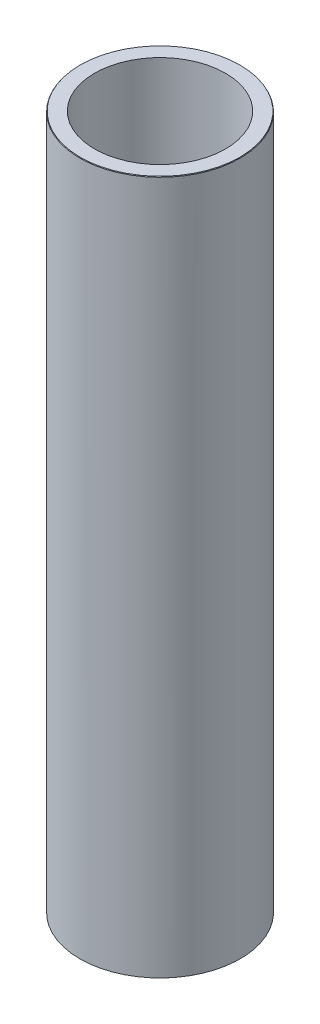
ISO-10303-21;
HEADER;
FILE_DESCRIPTION(('STEP AP214'),'2;1');
FILE_NAME('part.step','',(''),(''),'','','');
FILE_SCHEMA(('AUTOMOTIVE_DESIGN { 1 0 10303 214 1 1 1 1 }'));
ENDSEC;
DATA;
#1=APPLICATION_CONTEXT('core data for automotive mechanical design processes');
#2=APPLICATION_PROTOCOL_DEFINITION('international standard','automotive_design',2000,#1);
#3=PRODUCT_CONTEXT('',#1,'mechanical');
#4=PRODUCT('Part','Part','',(#3));
#5=PRODUCT_RELATED_PRODUCT_CATEGORY('part','',(#4));
#6=PRODUCT_DEFINITION_FORMATION('','',#4);
#7=PRODUCT_DEFINITION_CONTEXT('part definition',#1,'design');
#8=PRODUCT_DEFINITION('design','',#6,#7);
#9=PRODUCT_DEFINITION_SHAPE('','',#8);
#10=(LENGTH_UNIT() NAMED_UNIT(*) SI_UNIT(.MILLI.,.METRE.));
#11=(NAMED_UNIT(*) PLANE_ANGLE_UNIT() SI_UNIT($,.RADIAN.));
#12=(NAMED_UNIT(*) SI_UNIT($,.STERADIAN.) SOLID_ANGLE_UNIT());
#13=UNCERTAINTY_MEASURE_WITH_UNIT(LENGTH_MEASURE(1.E-05),#10,'distance_accuracy_value','');
#14=(GEOMETRIC_REPRESENTATION_CONTEXT(3) GLOBAL_UNCERTAINTY_ASSIGNED_CONTEXT((#13)) GLOBAL_UNIT_ASSIGNED_CONTEXT((#10,
#11,#12)) REPRESENTATION_CONTEXT('',''));
#15=CARTESIAN_POINT('',(0.,0.,0.));
#16=DIRECTION('',(0.,0.,1.));
#17=DIRECTION('',(1.,0.,0.));
#18=AXIS2_PLACEMENT_3D('',#15,#16,#17);
#19=CARTESIAN_POINT('',(0.,432.641620748387,0.));
#20=DIRECTION('',(0.,-1.,0.));
#21=DIRECTION('',(0.,0.,-1.));
#22=AXIS2_PLACEMENT_3D('',#19,#20,#21);
#23=CYLINDRICAL_SURFACE('',#22,50.);
#24=CARTESIAN_POINT('',(0.,432.255227948292,0.));
#25=DIRECTION('',(0.,1.,0.));
#26=DIRECTION('',(0.,0.,1.));
#27=AXIS2_PLACEMENT_3D('',#24,#25,#26);
#28=CIRCLE('',#27,50.);
#29=CARTESIAN_POINT('',(0.,432.255227948292,-50.));
#30=VERTEX_POINT('',#29);
#31=EDGE_CURVE('E50',#30,#30,#28,.F.);
#32=CARTESIAN_POINT('',(0.,0.245557043703271,0.));
#33=DIRECTION('',(0.,1.,0.));
#34=DIRECTION('',(0.,0.,1.));
#35=AXIS2_PLACEMENT_3D('',#32,#33,#34);
#36=CIRCLE('',#35,50.);
#37=CARTESIAN_POINT('',(0.,0.245557043703215,-50.));
#38=VERTEX_POINT('',#37);
#39=EDGE_CURVE('E51',#38,#38,#36,.T.);
#40=CARTESIAN_POINT('',(0.,432.255227948292,-50.));
#41=CARTESIAN_POINT('',(0.,427.755127209702,-50.));
#42=CARTESIAN_POINT('',(0.,423.255026471113,-50.));
#43=CARTESIAN_POINT('',(0.,414.254824993934,-50.));
#44=CARTESIAN_POINT('',(0.,409.754724255345,-50.));
#45=CARTESIAN_POINT('',(0.,400.754522778166,-50.));
#46=CARTESIAN_POINT('',(0.,396.254422039576,-50.));
#47=CARTESIAN_POINT('',(0.,387.254220562397,-50.));
#48=CARTESIAN_POINT('',(0.,382.754119823808,-50.));
#49=CARTESIAN_POINT('',(0.,373.753918346629,-50.));
#50=CARTESIAN_POINT('',(0.,369.253817608039,-50.));
#51=CARTESIAN_POINT('',(0.,360.253616130861,-50.));
#52=CARTESIAN_POINT('',(0.,355.753515392271,-50.));
#53=CARTESIAN_POINT('',(0.,346.753313915092,-50.));
#54=CARTESIAN_POINT('',(0.,342.253213176503,-50.));
#55=CARTESIAN_POINT('',(0.,333.253011699324,-50.));
#56=CARTESIAN_POINT('',(0.,328.752910960734,-50.));
#57=CARTESIAN_POINT('',(0.,319.752709483555,-50.));
#58=CARTESIAN_POINT('',(0.,315.252608744966,-50.));
#59=CARTESIAN_POINT('',(0.,306.252407267787,-50.));
#60=CARTESIAN_POINT('',(0.,301.752306529197,-50.));
#61=CARTESIAN_POINT('',(0.,292.752105052018,-50.));
#62=CARTESIAN_POINT('',(0.,288.252004313429,-50.));
#63=CARTESIAN_POINT('',(0.,279.25180283625,-50.));
#64=CARTESIAN_POINT('',(0.,274.751702097661,-50.));
#65=CARTESIAN_POINT('',(0.,265.751500620482,-50.));
#66=CARTESIAN_POINT('',(0.,261.251399881892,-50.));
#67=CARTESIAN_POINT('',(0.,252.251198404713,-50.));
#68=CARTESIAN_POINT('',(0.,247.751097666124,-50.));
#69=CARTESIAN_POINT('',(0.,238.750896188945,-50.));
#70=CARTESIAN_POINT('',(0.,234.250795450355,-50.));
#71=CARTESIAN_POINT('',(0.,225.250593973177,-50.));
#72=CARTESIAN_POINT('',(0.,220.750493234587,-50.));
#73=CARTESIAN_POINT('',(0.,211.750291757408,-50.));
#74=CARTESIAN_POINT('',(0.,207.250191018819,-50.));
#75=CARTESIAN_POINT('',(0.,198.24998954164,-50.));
#76=CARTESIAN_POINT('',(0.,193.74988880305,-50.));
#77=CARTESIAN_POINT('',(0.,184.749687325871,-50.));
#78=CARTESIAN_POINT('',(0.,180.249586587282,-50.));
#79=CARTESIAN_POINT('',(0.,171.249385110103,-50.));
#80=CARTESIAN_POINT('',(0.,166.749284371513,-50.));
#81=CARTESIAN_POINT('',(0.,157.749082894335,-50.));
#82=CARTESIAN_POINT('',(0.,153.248982155745,-50.));
#83=CARTESIAN_POINT('',(0.,144.248780678566,-50.));
#84=CARTESIAN_POINT('',(0.,139.748679939977,-50.));
#85=CARTESIAN_POINT('',(0.,130.748478462798,-50.));
#86=CARTESIAN_POINT('',(0.,126.248377724208,-50.));
#87=CARTESIAN_POINT('',(0.,117.248176247029,-50.));
#88=CARTESIAN_POINT('',(0.,112.74807550844,-50.));
#89=CARTESIAN_POINT('',(0.,103.747874031261,-50.));
#90=CARTESIAN_POINT('',(0.,99.2477732926715,-50.));
#91=CARTESIAN_POINT('',(0.,90.2475718154925,-50.));
#92=CARTESIAN_POINT('',(0.,85.7474710769031,-50.));
#93=CARTESIAN_POINT('',(0.,76.7472695997241,-50.));
#94=CARTESIAN_POINT('',(0.,72.2471688611347,-50.));
#95=CARTESIAN_POINT('',(0.,63.2469673839557,-50.));
#96=CARTESIAN_POINT('',(0.,58.7468666453663,-50.));
#97=CARTESIAN_POINT('',(0.,49.7466651681873,-50.));
#98=CARTESIAN_POINT('',(0.,45.2465644295979,-50.));
#99=CARTESIAN_POINT('',(0.,36.246362952419,-50.));
#100=CARTESIAN_POINT('',(0.,31.7462622138295,-50.));
#101=CARTESIAN_POINT('',(0.,22.7460607366505,-50.));
#102=CARTESIAN_POINT('',(0.,18.2459599980611,-50.));
#103=CARTESIAN_POINT('',(0.,9.24575852088216,-50.));
#104=CARTESIAN_POINT('',(0.,4.74565778229269,-50.));
#105=CARTESIAN_POINT('',(0.,0.245557043703215,-50.));
#106=B_SPLINE_CURVE_WITH_KNOTS('',3,(#40,#41,#42,#43,#44,#45,#46,#47,#48,#49,#50,#51,#52,#53,
#54,#55,#56,#57,#58,#59,#60,#61,#62,#63,#64,#65,#66,#67,#68,#69,#70,#71,#72,#73,#74,#75,#76,#77,
#78,#79,#80,#81,#82,#83,#84,#85,#86,#87,#88,#89,#90,#91,#92,#93,#94,#95,#96,#97,#98,#99,#100,
#101,#102,#103,#104,#105),.UNSPECIFIED.,.F.,.F.,(4,2,2,2,2,2,2,2,2,2,2,2,2,2,2,2,2,2,2,2,2,2,2,
2,2,2,2,2,2,2,2,2,4),(0.,13.5003022157684,27.0006044315368,40.5009066473052,54.0012088630736,
67.5015110788419,81.0018132946104,94.5021155103787,108.002417726147,121.502719941916,
135.003022157684,148.503324373452,162.003626589221,175.503928804989,189.004231020758,
202.504533236526,216.004835452294,229.505137668063,243.005439883831,256.5057420996,
270.006044315368,283.506346531136,297.006648746905,310.506950962673,324.007253178442,
337.50755539421,351.007857609978,364.508159825747,378.008462041515,391.508764257283,
405.009066473052,418.50936868882,432.009670904589),.UNSPECIFIED.);
#107=EDGE_CURVE('BSEAM39',#30,#38,#106,.T.);
#108=ORIENTED_EDGE('',*,*,#31,.T.);
#109=ORIENTED_EDGE('',*,*,#39,.T.);
#110=ORIENTED_EDGE('',*,*,#107,.T.);
#111=ORIENTED_EDGE('',*,*,#107,.F.);
#112=EDGE_LOOP('',(#108,#110,#109,#111));
#113=FACE_BOUND('',#112,.T.);
#114=ADVANCED_FACE('F39',(#113),#23,.T.);
#115=CARTESIAN_POINT('',(0.,432.641620748387,0.));
#116=DIRECTION('',(0.,1.,0.));
#117=DIRECTION('',(0.,0.,1.));
#118=AXIS2_PLACEMENT_3D('',#115,#116,#117);
#119=PLANE('',#118);
#120=CARTESIAN_POINT('',(0.,432.641620748387,0.));
#121=DIRECTION('',(0.,1.,0.));
#122=DIRECTION('',(0.,0.,1.));
#123=AXIS2_PLACEMENT_3D('',#120,#121,#122);
#124=CIRCLE('',#123,49.7544429562972);
#125=CARTESIAN_POINT('',(0.,432.641620748387,49.7544429562972));
#126=VERTEX_POINT('',#125);
#127=EDGE_CURVE('E54',#126,#126,#124,.T.);
#128=ORIENTED_EDGE('',*,*,#127,.T.);
#129=EDGE_LOOP('',(#128));
#130=FACE_BOUND('',#129,.T.);
#131=CARTESIAN_POINT('',(0.,432.641620748387,0.));
#132=DIRECTION('',(0.,1.,0.));
#133=DIRECTION('',(0.,0.,1.));
#134=AXIS2_PLACEMENT_3D('',#131,#132,#133);
#135=CIRCLE('',#134,40.8458833152404);
#136=CARTESIAN_POINT('',(0.,432.641620748387,-40.8458833152404));
#137=VERTEX_POINT('',#136);
#138=EDGE_CURVE('E58',#137,#137,#135,.T.);
#139=ORIENTED_EDGE('',*,*,#138,.F.);
#140=EDGE_LOOP('',(#139));
#141=FACE_BOUND('',#140,.T.);
#142=ADVANCED_FACE('F69',(#130,#141),#119,.T.);
#143=CARTESIAN_POINT('',(0.,0.,0.));
#144=DIRECTION('',(0.,1.,0.));
#145=DIRECTION('',(0.,0.,1.));
#146=AXIS2_PLACEMENT_3D('',#143,#144,#145);
#147=PLANE('',#146);
#148=CARTESIAN_POINT('',(0.,0.,0.));
#149=DIRECTION('',(0.,1.,0.));
#150=DIRECTION('',(0.,0.,1.));
#151=AXIS2_PLACEMENT_3D('',#148,#149,#150);
#152=CIRCLE('',#151,49.6136071999038);
#153=CARTESIAN_POINT('',(0.,0.,49.6136071999038));
#154=VERTEX_POINT('',#153);
#155=EDGE_CURVE('E10',#154,#154,#152,.F.);
#156=ORIENTED_EDGE('',*,*,#155,.T.);
#157=EDGE_LOOP('',(#156));
#158=FACE_BOUND('',#157,.T.);
#159=CARTESIAN_POINT('',(0.,0.,0.));
#160=DIRECTION('',(0.,1.,0.));
#161=DIRECTION('',(0.,0.,1.));
#162=AXIS2_PLACEMENT_3D('',#159,#160,#161);
#163=CIRCLE('',#162,40.8458833152404);
#164=CARTESIAN_POINT('',(0.,0.,-40.8458833152404));
#165=VERTEX_POINT('',#164);
#166=EDGE_CURVE('E63',#165,#165,#163,.T.);
#167=ORIENTED_EDGE('',*,*,#166,.T.);
#168=EDGE_LOOP('',(#167));
#169=FACE_BOUND('',#168,.T.);
#170=ADVANCED_FACE('F75',(#158,#169),#147,.F.);
#171=CARTESIAN_POINT('',(0.,432.641620748387,0.));
#172=DIRECTION('',(0.,-1.,0.));
#173=DIRECTION('',(0.,0.,-1.));
#174=AXIS2_PLACEMENT_3D('',#171,#172,#173);
#175=CYLINDRICAL_SURFACE('',#174,40.8458833152404);
#176=CARTESIAN_POINT('',(0.,432.641620748387,-40.8458833152404));
#177=CARTESIAN_POINT('',(0.,428.134937198925,-40.8458833152404));
#178=CARTESIAN_POINT('',(0.,423.628253649463,-40.8458833152404));
#179=CARTESIAN_POINT('',(0.,414.614886550538,-40.8458833152404));
#180=CARTESIAN_POINT('',(0.,410.108203001075,-40.8458833152404));
#181=CARTESIAN_POINT('',(0.,401.094835902151,-40.8458833152404));
#182=CARTESIAN_POINT('',(0.,396.588152352688,-40.8458833152404));
#183=CARTESIAN_POINT('',(0.,387.574785253764,-40.8458833152404));
#184=CARTESIAN_POINT('',(0.,383.068101704301,-40.8458833152404));
#185=CARTESIAN_POINT('',(0.,374.054734605377,-40.8458833152404));
#186=CARTESIAN_POINT('',(0.,369.548051055914,-40.8458833152404));
#187=CARTESIAN_POINT('',(0.,360.534683956989,-40.8458833152404));
#188=CARTESIAN_POINT('',(0.,356.028000407527,-40.8458833152404));
#189=CARTESIAN_POINT('',(0.,347.014633308602,-40.8458833152404));
#190=CARTESIAN_POINT('',(0.,342.50794975914,-40.8458833152404));
#191=CARTESIAN_POINT('',(0.,333.494582660215,-40.8458833152404));
#192=CARTESIAN_POINT('',(0.,328.987899110753,-40.8458833152404));
#193=CARTESIAN_POINT('',(0.,319.974532011828,-40.8458833152404));
#194=CARTESIAN_POINT('',(0.,315.467848462366,-40.8458833152404));
#195=CARTESIAN_POINT('',(0.,306.454481363441,-40.8458833152404));
#196=CARTESIAN_POINT('',(0.,301.947797813979,-40.8458833152404));
#197=CARTESIAN_POINT('',(0.,292.934430715054,-40.8458833152404));
#198=CARTESIAN_POINT('',(0.,288.427747165592,-40.8458833152404));
#199=CARTESIAN_POINT('',(0.,279.414380066667,-40.8458833152404));
#200=CARTESIAN_POINT('',(0.,274.907696517204,-40.8458833152404));
#201=CARTESIAN_POINT('',(0.,265.89432941828,-40.8458833152404));
#202=CARTESIAN_POINT('',(0.,261.387645868817,-40.8458833152404));
#203=CARTESIAN_POINT('',(0.,252.374278769893,-40.8458833152404));
#204=CARTESIAN_POINT('',(0.,247.86759522043,-40.8458833152404));
#205=CARTESIAN_POINT('',(0.,238.854228121505,-40.8458833152404));
#206=CARTESIAN_POINT('',(0.,234.347544572043,-40.8458833152404));
#207=CARTESIAN_POINT('',(0.,225.334177473118,-40.8458833152404));
#208=CARTESIAN_POINT('',(0.,220.827493923656,-40.8458833152404));
#209=CARTESIAN_POINT('',(0.,211.814126824731,-40.8458833152404));
#210=CARTESIAN_POINT('',(0.,207.307443275269,-40.8458833152404));
#211=CARTESIAN_POINT('',(0.,198.294076176344,-40.8458833152404));
#212=CARTESIAN_POINT('',(0.,193.787392626882,-40.8458833152404));
#213=CARTESIAN_POINT('',(0.,184.774025527957,-40.8458833152404));
#214=CARTESIAN_POINT('',(0.,180.267341978495,-40.8458833152404));
#215=CARTESIAN_POINT('',(0.,171.25397487957,-40.8458833152404));
#216=CARTESIAN_POINT('',(0.,166.747291330108,-40.8458833152404));
#217=CARTESIAN_POINT('',(0.,157.733924231183,-40.8458833152404));
#218=CARTESIAN_POINT('',(0.,153.227240681721,-40.8458833152404));
#219=CARTESIAN_POINT('',(0.,144.213873582796,-40.8458833152404));
#220=CARTESIAN_POINT('',(0.,139.707190033333,-40.8458833152404));
#221=CARTESIAN_POINT('',(0.,130.693822934409,-40.8458833152404));
#222=CARTESIAN_POINT('',(0.,126.187139384946,-40.8458833152404));
#223=CARTESIAN_POINT('',(0.,117.173772286022,-40.8458833152404));
#224=CARTESIAN_POINT('',(0.,112.667088736559,-40.8458833152404));
#225=CARTESIAN_POINT('',(0.,103.653721637634,-40.8458833152404));
#226=CARTESIAN_POINT('',(0.,99.1470380881721,-40.8458833152404));
#227=CARTESIAN_POINT('',(0.,90.1336709892474,-40.8458833152404));
#228=CARTESIAN_POINT('',(0.,85.626987439785,-40.8458833152404));
#229=CARTESIAN_POINT('',(0.,76.6136203408603,-40.8458833152404));
#230=CARTESIAN_POINT('',(0.,72.1069367913979,-40.8458833152404));
#231=CARTESIAN_POINT('',(0.,63.0935696924732,-40.8458833152404));
#232=CARTESIAN_POINT('',(0.,58.5868861430108,-40.8458833152404));
#233=CARTESIAN_POINT('',(0.,49.573519044086,-40.8458833152404));
#234=CARTESIAN_POINT('',(0.,45.0668354946237,-40.8458833152404));
#235=CARTESIAN_POINT('',(0.,36.0534683956989,-40.8458833152404));
#236=CARTESIAN_POINT('',(0.,31.5467848462366,-40.8458833152404));
#237=CARTESIAN_POINT('',(0.,22.5334177473118,-40.8458833152404));
#238=CARTESIAN_POINT('',(0.,18.0267341978495,-40.8458833152404));
#239=CARTESIAN_POINT('',(0.,9.01336709892476,-40.8458833152404));
#240=CARTESIAN_POINT('',(0.,4.50668354946238,-40.8458833152404));
#241=CARTESIAN_POINT('',(0.,0.,-40.8458833152404));
#242=B_SPLINE_CURVE_WITH_KNOTS('',3,(#176,#177,#178,#179,#180,#181,#182,#183,#184,#185,#186,
#187,#188,#189,#190,#191,#192,#193,#194,#195,#196,#197,#198,#199,#200,#201,#202,#203,#204,#205,
#206,#207,#208,#209,#210,#211,#212,#213,#214,#215,#216,#217,#218,#219,#220,#221,#222,#223,#224,
#225,#226,#227,#228,#229,#230,#231,#232,#233,#234,#235,#236,#237,#238,#239,#240,#241),
.UNSPECIFIED.,.F.,.F.,(4,2,2,2,2,2,2,2,2,2,2,2,2,2,2,2,2,2,2,2,2,2,2,2,2,2,2,2,2,2,2,2,4),(0.,
13.5200506483871,27.0401012967743,40.5601519451613,54.0802025935485,67.6002532419355,
81.1203038903227,94.6403545387098,108.160405187097,121.680455835484,135.200506483871,
148.720557132258,162.240607780645,175.760658429032,189.28070907742,202.800759725807,
216.320810374194,229.840861022581,243.360911670968,256.880962319355,270.401012967742,
283.921063616129,297.441114264516,310.961164912903,324.481215561291,338.001266209678,
351.521316858065,365.041367506452,378.561418154839,392.081468803226,405.601519451613,
419.1215701,432.641620748387),.UNSPECIFIED.);
#243=EDGE_CURVE('BSEAM70',#137,#165,#242,.T.);
#244=ORIENTED_EDGE('',*,*,#138,.T.);
#245=ORIENTED_EDGE('',*,*,#166,.F.);
#246=ORIENTED_EDGE('',*,*,#243,.T.);
#247=ORIENTED_EDGE('',*,*,#243,.F.);
#248=EDGE_LOOP('',(#244,#246,#245,#247));
#249=FACE_BOUND('',#248,.T.);
#250=ADVANCED_FACE('F70',(#249),#175,.F.);
#251=CARTESIAN_POINT('',(0.,432.641620748387,0.));
#252=DIRECTION('',(0.,-1.,0.));
#253=DIRECTION('',(0.,0.,-1.));
#254=AXIS2_PLACEMENT_3D('',#251,#252,#253);
#255=CONICAL_SURFACE('',#254,49.7544429562972,0.566122418071055);
#256=ORIENTED_EDGE('',*,*,#31,.F.);
#257=EDGE_LOOP('',(#256));
#258=FACE_BOUND('',#257,.T.);
#259=ORIENTED_EDGE('',*,*,#127,.F.);
#260=EDGE_LOOP('',(#259));
#261=FACE_BOUND('',#260,.T.);
#262=ADVANCED_FACE('F81',(#258,#261),#255,.T.);
#263=CARTESIAN_POINT('',(0.,0.245557043703271,0.));
#264=DIRECTION('',(0.,1.,0.));
#265=DIRECTION('',(0.,0.,1.));
#266=AXIS2_PLACEMENT_3D('',#263,#264,#265);
#267=CONICAL_SURFACE('',#266,50.,1.00467390872389);
#268=ORIENTED_EDGE('',*,*,#155,.F.);
#269=EDGE_LOOP('',(#268));
#270=FACE_BOUND('',#269,.T.);
#271=ORIENTED_EDGE('',*,*,#39,.F.);
#272=EDGE_LOOP('',(#271));
#273=FACE_BOUND('',#272,.T.);
#274=ADVANCED_FACE('F45',(#270,#273),#267,.T.);
#275=CLOSED_SHELL('',(#114,#142,#170,#250,#262,#274));
#276=MANIFOLD_SOLID_BREP('B2',#275);
#277=ADVANCED_BREP_SHAPE_REPRESENTATION('',(#18,#276),#14);
#278=SHAPE_DEFINITION_REPRESENTATION(#9,#277);
ENDSEC;
END-ISO-10303-21;
